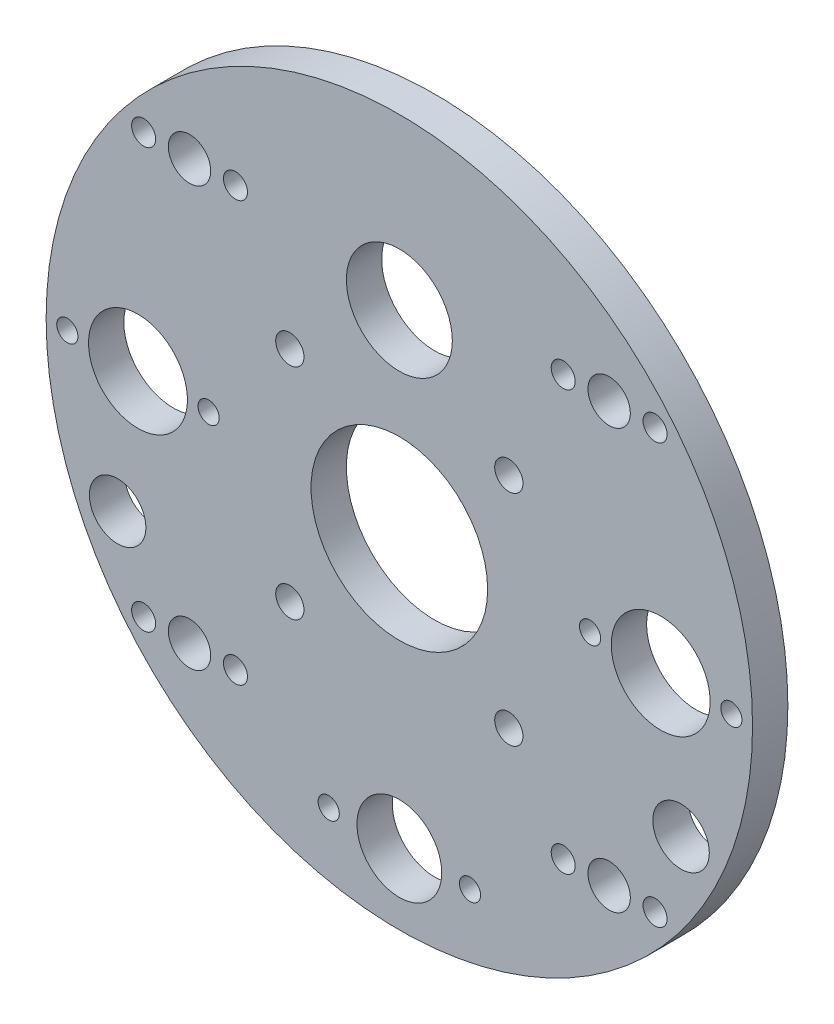
ISO-10303-21;
HEADER;
FILE_DESCRIPTION(('STEP AP214'),'2;1');
FILE_NAME('part.step','',(''),(''),'','','');
FILE_SCHEMA(('AUTOMOTIVE_DESIGN { 1 0 10303 214 1 1 1 1 }'));
ENDSEC;
DATA;
#1=APPLICATION_CONTEXT('core data for automotive mechanical design processes');
#2=APPLICATION_PROTOCOL_DEFINITION('international standard','automotive_design',2000,#1);
#3=PRODUCT_CONTEXT('',#1,'mechanical');
#4=PRODUCT('Part','Part','',(#3));
#5=PRODUCT_RELATED_PRODUCT_CATEGORY('part','',(#4));
#6=PRODUCT_DEFINITION_FORMATION('','',#4);
#7=PRODUCT_DEFINITION_CONTEXT('part definition',#1,'design');
#8=PRODUCT_DEFINITION('design','',#6,#7);
#9=PRODUCT_DEFINITION_SHAPE('','',#8);
#10=(LENGTH_UNIT() NAMED_UNIT(*) SI_UNIT(.MILLI.,.METRE.));
#11=(NAMED_UNIT(*) PLANE_ANGLE_UNIT() SI_UNIT($,.RADIAN.));
#12=(NAMED_UNIT(*) SI_UNIT($,.STERADIAN.) SOLID_ANGLE_UNIT());
#13=UNCERTAINTY_MEASURE_WITH_UNIT(LENGTH_MEASURE(1.E-05),#10,'distance_accuracy_value','');
#14=(GEOMETRIC_REPRESENTATION_CONTEXT(3) GLOBAL_UNCERTAINTY_ASSIGNED_CONTEXT((#13)) GLOBAL_UNIT_ASSIGNED_CONTEXT((#10,
#11,#12)) REPRESENTATION_CONTEXT('',''));
#15=CARTESIAN_POINT('',(0.,0.,0.));
#16=DIRECTION('',(0.,0.,1.));
#17=DIRECTION('',(1.,0.,0.));
#18=AXIS2_PLACEMENT_3D('',#15,#16,#17);
#19=CARTESIAN_POINT('',(0.,0.,5.));
#20=DIRECTION('',(0.,0.,-1.));
#21=DIRECTION('',(-1.,0.,0.));
#22=AXIS2_PLACEMENT_3D('',#19,#20,#21);
#23=CYLINDRICAL_SURFACE('',#22,50.);
#24=CARTESIAN_POINT('',(0.,0.,5.));
#25=DIRECTION('',(0.,0.,1.));
#26=DIRECTION('',(1.,0.,0.));
#27=AXIS2_PLACEMENT_3D('',#24,#25,#26);
#28=CIRCLE('',#27,50.);
#29=CARTESIAN_POINT('',(50.,0.,5.));
#30=VERTEX_POINT('',#29);
#31=EDGE_CURVE('E10',#30,#30,#28,.T.);
#32=ORIENTED_EDGE('',*,*,#31,.F.);
#33=EDGE_LOOP('',(#32));
#34=FACE_BOUND('',#33,.T.);
#35=CARTESIAN_POINT('',(0.,0.,0.));
#36=DIRECTION('',(0.,0.,1.));
#37=DIRECTION('',(1.,0.,0.));
#38=AXIS2_PLACEMENT_3D('',#35,#36,#37);
#39=CIRCLE('',#38,50.);
#40=CARTESIAN_POINT('',(50.,0.,0.));
#41=VERTEX_POINT('',#40);
#42=EDGE_CURVE('E39',#41,#41,#39,.T.);
#43=ORIENTED_EDGE('',*,*,#42,.T.);
#44=EDGE_LOOP('',(#43));
#45=FACE_BOUND('',#44,.T.);
#46=ADVANCED_FACE('F32',(#34,#45),#23,.T.);
#47=CARTESIAN_POINT('',(0.,0.,5.));
#48=DIRECTION('',(0.,0.,1.));
#49=DIRECTION('',(1.,0.,0.));
#50=AXIS2_PLACEMENT_3D('',#47,#48,#49);
#51=PLANE('',#50);
#52=CARTESIAN_POINT('',(36.1984848098349,-29.6984848098351,5.));
#53=DIRECTION('',(0.,0.,1.));
#54=DIRECTION('',(1.,0.,0.));
#55=AXIS2_PLACEMENT_3D('',#52,#53,#54);
#56=CIRCLE('',#55,1.7);
#57=CARTESIAN_POINT('',(37.8984848098349,-29.6984848098351,5.));
#58=VERTEX_POINT('',#57);
#59=EDGE_CURVE('E209',#58,#58,#56,.T.);
#60=ORIENTED_EDGE('',*,*,#59,.F.);
#61=EDGE_LOOP('',(#60));
#62=FACE_BOUND('',#61,.T.);
#63=CARTESIAN_POINT('',(23.1984848098349,-29.6984848098351,5.));
#64=DIRECTION('',(0.,0.,1.));
#65=DIRECTION('',(1.,0.,0.));
#66=AXIS2_PLACEMENT_3D('',#63,#64,#65);
#67=CIRCLE('',#66,1.7);
#68=CARTESIAN_POINT('',(24.8984848098349,-29.6984848098351,5.));
#69=VERTEX_POINT('',#68);
#70=EDGE_CURVE('E213',#69,#69,#67,.T.);
#71=ORIENTED_EDGE('',*,*,#70,.F.);
#72=EDGE_LOOP('',(#71));
#73=FACE_BOUND('',#72,.T.);
#74=CARTESIAN_POINT('',(36.1984848098349,29.6984848098351,5.));
#75=DIRECTION('',(0.,0.,1.));
#76=DIRECTION('',(1.,0.,0.));
#77=AXIS2_PLACEMENT_3D('',#74,#75,#76);
#78=CIRCLE('',#77,1.7);
#79=CARTESIAN_POINT('',(37.8984848098349,29.6984848098351,5.));
#80=VERTEX_POINT('',#79);
#81=EDGE_CURVE('E217',#80,#80,#78,.T.);
#82=ORIENTED_EDGE('',*,*,#81,.F.);
#83=EDGE_LOOP('',(#82));
#84=FACE_BOUND('',#83,.T.);
#85=CARTESIAN_POINT('',(23.1984848098349,29.6984848098351,5.));
#86=DIRECTION('',(0.,0.,1.));
#87=DIRECTION('',(1.,0.,0.));
#88=AXIS2_PLACEMENT_3D('',#85,#86,#87);
#89=CIRCLE('',#88,1.7);
#90=CARTESIAN_POINT('',(24.8984848098349,29.6984848098351,5.));
#91=VERTEX_POINT('',#90);
#92=EDGE_CURVE('E221',#91,#91,#89,.T.);
#93=ORIENTED_EDGE('',*,*,#92,.F.);
#94=EDGE_LOOP('',(#93));
#95=FACE_BOUND('',#94,.T.);
#96=CARTESIAN_POINT('',(-36.1984848098349,29.6984848098351,5.));
#97=DIRECTION('',(0.,0.,1.));
#98=DIRECTION('',(1.,0.,0.));
#99=AXIS2_PLACEMENT_3D('',#96,#97,#98);
#100=CIRCLE('',#99,1.7);
#101=CARTESIAN_POINT('',(-34.4984848098349,29.6984848098351,5.));
#102=VERTEX_POINT('',#101);
#103=EDGE_CURVE('E225',#102,#102,#100,.T.);
#104=ORIENTED_EDGE('',*,*,#103,.F.);
#105=EDGE_LOOP('',(#104));
#106=FACE_BOUND('',#105,.T.);
#107=CARTESIAN_POINT('',(-23.1984848098349,29.6984848098351,5.));
#108=DIRECTION('',(0.,0.,1.));
#109=DIRECTION('',(1.,0.,0.));
#110=AXIS2_PLACEMENT_3D('',#107,#108,#109);
#111=CIRCLE('',#110,1.7);
#112=CARTESIAN_POINT('',(-21.4984848098349,29.6984848098351,5.));
#113=VERTEX_POINT('',#112);
#114=EDGE_CURVE('E229',#113,#113,#111,.T.);
#115=ORIENTED_EDGE('',*,*,#114,.F.);
#116=EDGE_LOOP('',(#115));
#117=FACE_BOUND('',#116,.T.);
#118=CARTESIAN_POINT('',(-36.1984848098349,-29.6984848098351,5.));
#119=DIRECTION('',(0.,0.,1.));
#120=DIRECTION('',(1.,0.,0.));
#121=AXIS2_PLACEMENT_3D('',#118,#119,#120);
#122=CIRCLE('',#121,1.7);
#123=CARTESIAN_POINT('',(-34.4984848098349,-29.6984848098351,5.));
#124=VERTEX_POINT('',#123);
#125=EDGE_CURVE('E233',#124,#124,#122,.T.);
#126=ORIENTED_EDGE('',*,*,#125,.F.);
#127=EDGE_LOOP('',(#126));
#128=FACE_BOUND('',#127,.T.);
#129=CARTESIAN_POINT('',(-23.1984848098349,-29.6984848098351,5.));
#130=DIRECTION('',(0.,0.,1.));
#131=DIRECTION('',(1.,0.,0.));
#132=AXIS2_PLACEMENT_3D('',#129,#130,#131);
#133=CIRCLE('',#132,1.7);
#134=CARTESIAN_POINT('',(-21.4984848098349,-29.6984848098351,5.));
#135=VERTEX_POINT('',#134);
#136=EDGE_CURVE('E237',#135,#135,#133,.T.);
#137=ORIENTED_EDGE('',*,*,#136,.F.);
#138=EDGE_LOOP('',(#137));
#139=FACE_BOUND('',#138,.T.);
#140=CARTESIAN_POINT('',(-39.8775426296126,-18.5952035165907,5.));
#141=DIRECTION('',(0.,0.,1.));
#142=DIRECTION('',(1.,0.,0.));
#143=AXIS2_PLACEMENT_3D('',#140,#141,#142);
#144=CIRCLE('',#143,4.00000000000001);
#145=CARTESIAN_POINT('',(-35.8775426296126,-18.5952035165907,5.));
#146=VERTEX_POINT('',#145);
#147=EDGE_CURVE('E109',#146,#146,#144,.T.);
#148=ORIENTED_EDGE('',*,*,#147,.F.);
#149=EDGE_LOOP('',(#148));
#150=FACE_BOUND('',#149,.T.);
#151=CARTESIAN_POINT('',(39.8775426296126,-18.5952035165907,5.));
#152=DIRECTION('',(0.,0.,1.));
#153=DIRECTION('',(-1.,0.,0.));
#154=AXIS2_PLACEMENT_3D('',#151,#152,#153);
#155=CIRCLE('',#154,4.00000000000001);
#156=CARTESIAN_POINT('',(35.8775426296126,-18.5952035165907,5.));
#157=VERTEX_POINT('',#156);
#158=EDGE_CURVE('E115',#157,#157,#155,.T.);
#159=ORIENTED_EDGE('',*,*,#158,.F.);
#160=EDGE_LOOP('',(#159));
#161=FACE_BOUND('',#160,.T.);
#162=CARTESIAN_POINT('',(-47.,0.,5.));
#163=DIRECTION('',(0.,0.,1.));
#164=DIRECTION('',(1.,0.,0.));
#165=AXIS2_PLACEMENT_3D('',#162,#163,#164);
#166=CIRCLE('',#165,1.5);
#167=CARTESIAN_POINT('',(-45.5,0.,5.));
#168=VERTEX_POINT('',#167);
#169=EDGE_CURVE('E89',#168,#168,#166,.T.);
#170=ORIENTED_EDGE('',*,*,#169,.F.);
#171=EDGE_LOOP('',(#170));
#172=FACE_BOUND('',#171,.T.);
#173=CARTESIAN_POINT('',(0.,-40.,5.));
#174=DIRECTION('',(0.,0.,1.));
#175=DIRECTION('',(1.,0.,0.));
#176=AXIS2_PLACEMENT_3D('',#173,#174,#175);
#177=CIRCLE('',#176,6.);
#178=CARTESIAN_POINT('',(6.,-40.,5.));
#179=VERTEX_POINT('',#178);
#180=EDGE_CURVE('E113',#179,#179,#177,.T.);
#181=ORIENTED_EDGE('',*,*,#180,.F.);
#182=EDGE_LOOP('',(#181));
#183=FACE_BOUND('',#182,.T.);
#184=CARTESIAN_POINT('',(10.,-40.,5.));
#185=DIRECTION('',(0.,0.,1.));
#186=DIRECTION('',(1.,0.,0.));
#187=AXIS2_PLACEMENT_3D('',#184,#185,#186);
#188=CIRCLE('',#187,1.5);
#189=CARTESIAN_POINT('',(11.5,-40.,5.));
#190=VERTEX_POINT('',#189);
#191=EDGE_CURVE('E128',#190,#190,#188,.T.);
#192=ORIENTED_EDGE('',*,*,#191,.F.);
#193=EDGE_LOOP('',(#192));
#194=FACE_BOUND('',#193,.T.);
#195=CARTESIAN_POINT('',(-27.,0.,5.));
#196=DIRECTION('',(0.,0.,1.));
#197=DIRECTION('',(1.,0.,0.));
#198=AXIS2_PLACEMENT_3D('',#195,#196,#197);
#199=CIRCLE('',#198,1.5);
#200=CARTESIAN_POINT('',(-25.5,0.,5.));
#201=VERTEX_POINT('',#200);
#202=EDGE_CURVE('E127',#201,#201,#199,.T.);
#203=ORIENTED_EDGE('',*,*,#202,.F.);
#204=EDGE_LOOP('',(#203));
#205=FACE_BOUND('',#204,.T.);
#206=CARTESIAN_POINT('',(27.,0.,5.));
#207=DIRECTION('',(0.,0.,1.));
#208=DIRECTION('',(1.,0.,0.));
#209=AXIS2_PLACEMENT_3D('',#206,#207,#208);
#210=CIRCLE('',#209,1.5);
#211=CARTESIAN_POINT('',(28.5,0.,5.));
#212=VERTEX_POINT('',#211);
#213=EDGE_CURVE('E137',#212,#212,#210,.T.);
#214=ORIENTED_EDGE('',*,*,#213,.F.);
#215=EDGE_LOOP('',(#214));
#216=FACE_BOUND('',#215,.T.);
#217=CARTESIAN_POINT('',(47.,0.,5.));
#218=DIRECTION('',(0.,0.,1.));
#219=DIRECTION('',(1.,0.,0.));
#220=AXIS2_PLACEMENT_3D('',#217,#218,#219);
#221=CIRCLE('',#220,1.5);
#222=CARTESIAN_POINT('',(48.5,0.,5.));
#223=VERTEX_POINT('',#222);
#224=EDGE_CURVE('E134',#223,#223,#221,.T.);
#225=ORIENTED_EDGE('',*,*,#224,.F.);
#226=EDGE_LOOP('',(#225));
#227=FACE_BOUND('',#226,.T.);
#228=CARTESIAN_POINT('',(-10.,-40.,5.));
#229=DIRECTION('',(0.,0.,1.));
#230=DIRECTION('',(1.,0.,0.));
#231=AXIS2_PLACEMENT_3D('',#228,#229,#230);
#232=CIRCLE('',#231,1.5);
#233=CARTESIAN_POINT('',(-8.5,-40.,5.));
#234=VERTEX_POINT('',#233);
#235=EDGE_CURVE('E131',#234,#234,#232,.T.);
#236=ORIENTED_EDGE('',*,*,#235,.F.);
#237=EDGE_LOOP('',(#236));
#238=FACE_BOUND('',#237,.T.);
#239=CARTESIAN_POINT('',(-29.6984848098349,-29.6984848098351,5.));
#240=DIRECTION('',(0.,0.,1.));
#241=DIRECTION('',(0.,1.,0.));
#242=AXIS2_PLACEMENT_3D('',#239,#240,#241);
#243=CIRCLE('',#242,3.);
#244=CARTESIAN_POINT('',(-29.6984848098349,-26.6984848098351,5.));
#245=VERTEX_POINT('',#244);
#246=EDGE_CURVE('E79',#245,#245,#243,.T.);
#247=ORIENTED_EDGE('',*,*,#246,.F.);
#248=EDGE_LOOP('',(#247));
#249=FACE_BOUND('',#248,.T.);
#250=CARTESIAN_POINT('',(29.6984848098349,-29.698484809835,5.));
#251=DIRECTION('',(0.,0.,1.));
#252=DIRECTION('',(-1.,0.,0.));
#253=AXIS2_PLACEMENT_3D('',#250,#251,#252);
#254=CIRCLE('',#253,3.);
#255=CARTESIAN_POINT('',(26.698484809835,-29.698484809835,5.));
#256=VERTEX_POINT('',#255);
#257=EDGE_CURVE('E146',#256,#256,#254,.T.);
#258=ORIENTED_EDGE('',*,*,#257,.F.);
#259=EDGE_LOOP('',(#258));
#260=FACE_BOUND('',#259,.T.);
#261=CARTESIAN_POINT('',(29.6984848098347,29.6984848098353,5.));
#262=DIRECTION('',(0.,0.,1.));
#263=DIRECTION('',(0.,-1.,0.));
#264=AXIS2_PLACEMENT_3D('',#261,#262,#263);
#265=CIRCLE('',#264,3.);
#266=CARTESIAN_POINT('',(29.6984848098348,26.6984848098353,5.));
#267=VERTEX_POINT('',#266);
#268=EDGE_CURVE('E106',#267,#267,#265,.T.);
#269=ORIENTED_EDGE('',*,*,#268,.F.);
#270=EDGE_LOOP('',(#269));
#271=FACE_BOUND('',#270,.T.);
#272=CARTESIAN_POINT('',(-29.6984848098349,29.698484809835,5.));
#273=DIRECTION('',(0.,0.,1.));
#274=DIRECTION('',(1.,0.,0.));
#275=AXIS2_PLACEMENT_3D('',#272,#273,#274);
#276=CIRCLE('',#275,3.);
#277=CARTESIAN_POINT('',(-26.698484809835,29.698484809835,5.));
#278=VERTEX_POINT('',#277);
#279=EDGE_CURVE('E74',#278,#278,#276,.T.);
#280=ORIENTED_EDGE('',*,*,#279,.F.);
#281=EDGE_LOOP('',(#280));
#282=FACE_BOUND('',#281,.T.);
#283=CARTESIAN_POINT('',(-15.4999999999989,-17.5000000000002,5.));
#284=DIRECTION('',(0.,0.,1.));
#285=DIRECTION('',(1.,0.,0.));
#286=AXIS2_PLACEMENT_3D('',#283,#284,#285);
#287=CIRCLE('',#286,2.);
#288=CARTESIAN_POINT('',(-13.4999999999989,-17.5000000000002,5.));
#289=VERTEX_POINT('',#288);
#290=EDGE_CURVE('E73',#289,#289,#287,.T.);
#291=ORIENTED_EDGE('',*,*,#290,.F.);
#292=EDGE_LOOP('',(#291));
#293=FACE_BOUND('',#292,.T.);
#294=CARTESIAN_POINT('',(15.5000000000015,-17.4999999999992,5.));
#295=DIRECTION('',(0.,0.,1.));
#296=DIRECTION('',(1.,0.,0.));
#297=AXIS2_PLACEMENT_3D('',#294,#295,#296);
#298=CIRCLE('',#297,2.);
#299=CARTESIAN_POINT('',(17.5000000000015,-17.4999999999992,5.));
#300=VERTEX_POINT('',#299);
#301=EDGE_CURVE('E159',#300,#300,#298,.T.);
#302=ORIENTED_EDGE('',*,*,#301,.F.);
#303=EDGE_LOOP('',(#302));
#304=FACE_BOUND('',#303,.T.);
#305=CARTESIAN_POINT('',(15.5000000000004,13.5000000000012,5.));
#306=DIRECTION('',(0.,0.,1.));
#307=DIRECTION('',(1.,0.,0.));
#308=AXIS2_PLACEMENT_3D('',#305,#306,#307);
#309=CIRCLE('',#308,2.);
#310=CARTESIAN_POINT('',(17.5000000000004,13.5000000000012,5.));
#311=VERTEX_POINT('',#310);
#312=EDGE_CURVE('E156',#311,#311,#309,.T.);
#313=ORIENTED_EDGE('',*,*,#312,.F.);
#314=EDGE_LOOP('',(#313));
#315=FACE_BOUND('',#314,.T.);
#316=CARTESIAN_POINT('',(-15.5,13.5,5.));
#317=DIRECTION('',(0.,0.,1.));
#318=DIRECTION('',(1.,0.,0.));
#319=AXIS2_PLACEMENT_3D('',#316,#317,#318);
#320=CIRCLE('',#319,2.);
#321=CARTESIAN_POINT('',(-13.5,13.5,5.));
#322=VERTEX_POINT('',#321);
#323=EDGE_CURVE('E153',#322,#322,#320,.T.);
#324=ORIENTED_EDGE('',*,*,#323,.F.);
#325=EDGE_LOOP('',(#324));
#326=FACE_BOUND('',#325,.T.);
#327=CARTESIAN_POINT('',(0.,-2.,5.));
#328=DIRECTION('',(0.,0.,1.));
#329=DIRECTION('',(1.,0.,0.));
#330=AXIS2_PLACEMENT_3D('',#327,#328,#329);
#331=CIRCLE('',#330,12.5);
#332=CARTESIAN_POINT('',(12.5,-2.,5.));
#333=VERTEX_POINT('',#332);
#334=EDGE_CURVE('E58',#333,#333,#331,.T.);
#335=ORIENTED_EDGE('',*,*,#334,.F.);
#336=EDGE_LOOP('',(#335));
#337=FACE_BOUND('',#336,.T.);
#338=CARTESIAN_POINT('',(0.,26.,5.));
#339=DIRECTION('',(0.,0.,1.));
#340=DIRECTION('',(1.,0.,0.));
#341=AXIS2_PLACEMENT_3D('',#338,#339,#340);
#342=CIRCLE('',#341,7.5);
#343=CARTESIAN_POINT('',(7.5,26.,5.));
#344=VERTEX_POINT('',#343);
#345=EDGE_CURVE('E53',#344,#344,#342,.T.);
#346=ORIENTED_EDGE('',*,*,#345,.F.);
#347=EDGE_LOOP('',(#346));
#348=FACE_BOUND('',#347,.T.);
#349=CARTESIAN_POINT('',(-37.,0.,5.));
#350=DIRECTION('',(0.,0.,-1.));
#351=DIRECTION('',(-1.,0.,0.));
#352=AXIS2_PLACEMENT_3D('',#349,#350,#351);
#353=CIRCLE('',#352,7.);
#354=CARTESIAN_POINT('',(-44.,0.,5.));
#355=VERTEX_POINT('',#354);
#356=EDGE_CURVE('E170',#355,#355,#353,.T.);
#357=ORIENTED_EDGE('',*,*,#356,.T.);
#358=EDGE_LOOP('',(#357));
#359=FACE_BOUND('',#358,.T.);
#360=CARTESIAN_POINT('',(37.,2.68166793467571E-13,5.));
#361=DIRECTION('',(0.,0.,-1.));
#362=DIRECTION('',(-1.,0.,0.));
#363=AXIS2_PLACEMENT_3D('',#360,#361,#362);
#364=CIRCLE('',#363,7.);
#365=CARTESIAN_POINT('',(30.,2.68166793467571E-13,5.));
#366=VERTEX_POINT('',#365);
#367=EDGE_CURVE('E44',#366,#366,#364,.T.);
#368=ORIENTED_EDGE('',*,*,#367,.T.);
#369=EDGE_LOOP('',(#368));
#370=FACE_BOUND('',#369,.T.);
#371=ORIENTED_EDGE('',*,*,#31,.T.);
#372=EDGE_LOOP('',(#371));
#373=FACE_BOUND('',#372,.T.);
#374=ADVANCED_FACE('F179',(#62,#73,#84,#95,#106,#117,#128,#139,#150,#161,#172,#183,#194,#205,
#216,#227,#238,#249,#260,#271,#282,#293,#304,#315,#326,#337,#348,#359,#370,#373),#51,.T.);
#375=CARTESIAN_POINT('',(0.,0.,0.));
#376=DIRECTION('',(0.,0.,1.));
#377=DIRECTION('',(1.,0.,0.));
#378=AXIS2_PLACEMENT_3D('',#375,#376,#377);
#379=PLANE('',#378);
#380=CARTESIAN_POINT('',(36.1984848098349,-29.6984848098351,0.));
#381=DIRECTION('',(0.,0.,1.));
#382=DIRECTION('',(1.,0.,0.));
#383=AXIS2_PLACEMENT_3D('',#380,#381,#382);
#384=CIRCLE('',#383,1.7);
#385=CARTESIAN_POINT('',(37.8984848098349,-29.6984848098351,0.));
#386=VERTEX_POINT('',#385);
#387=EDGE_CURVE('E396',#386,#386,#384,.T.);
#388=ORIENTED_EDGE('',*,*,#387,.T.);
#389=EDGE_LOOP('',(#388));
#390=FACE_BOUND('',#389,.T.);
#391=CARTESIAN_POINT('',(23.1984848098349,-29.6984848098351,0.));
#392=DIRECTION('',(0.,0.,1.));
#393=DIRECTION('',(1.,0.,0.));
#394=AXIS2_PLACEMENT_3D('',#391,#392,#393);
#395=CIRCLE('',#394,1.7);
#396=CARTESIAN_POINT('',(24.8984848098349,-29.6984848098351,0.));
#397=VERTEX_POINT('',#396);
#398=EDGE_CURVE('E401',#397,#397,#395,.T.);
#399=ORIENTED_EDGE('',*,*,#398,.T.);
#400=EDGE_LOOP('',(#399));
#401=FACE_BOUND('',#400,.T.);
#402=CARTESIAN_POINT('',(36.1984848098349,29.6984848098351,0.));
#403=DIRECTION('',(0.,0.,1.));
#404=DIRECTION('',(1.,0.,0.));
#405=AXIS2_PLACEMENT_3D('',#402,#403,#404);
#406=CIRCLE('',#405,1.7);
#407=CARTESIAN_POINT('',(37.8984848098349,29.6984848098351,0.));
#408=VERTEX_POINT('',#407);
#409=EDGE_CURVE('E405',#408,#408,#406,.T.);
#410=ORIENTED_EDGE('',*,*,#409,.T.);
#411=EDGE_LOOP('',(#410));
#412=FACE_BOUND('',#411,.T.);
#413=CARTESIAN_POINT('',(23.1984848098349,29.6984848098351,0.));
#414=DIRECTION('',(0.,0.,1.));
#415=DIRECTION('',(1.,0.,0.));
#416=AXIS2_PLACEMENT_3D('',#413,#414,#415);
#417=CIRCLE('',#416,1.7);
#418=CARTESIAN_POINT('',(24.8984848098349,29.6984848098351,0.));
#419=VERTEX_POINT('',#418);
#420=EDGE_CURVE('E409',#419,#419,#417,.T.);
#421=ORIENTED_EDGE('',*,*,#420,.T.);
#422=EDGE_LOOP('',(#421));
#423=FACE_BOUND('',#422,.T.);
#424=CARTESIAN_POINT('',(-36.1984848098349,29.6984848098351,0.));
#425=DIRECTION('',(0.,0.,1.));
#426=DIRECTION('',(1.,0.,0.));
#427=AXIS2_PLACEMENT_3D('',#424,#425,#426);
#428=CIRCLE('',#427,1.7);
#429=CARTESIAN_POINT('',(-34.4984848098349,29.6984848098351,0.));
#430=VERTEX_POINT('',#429);
#431=EDGE_CURVE('E413',#430,#430,#428,.T.);
#432=ORIENTED_EDGE('',*,*,#431,.T.);
#433=EDGE_LOOP('',(#432));
#434=FACE_BOUND('',#433,.T.);
#435=CARTESIAN_POINT('',(-23.1984848098349,29.6984848098351,0.));
#436=DIRECTION('',(0.,0.,1.));
#437=DIRECTION('',(1.,0.,0.));
#438=AXIS2_PLACEMENT_3D('',#435,#436,#437);
#439=CIRCLE('',#438,1.7);
#440=CARTESIAN_POINT('',(-21.4984848098349,29.6984848098351,0.));
#441=VERTEX_POINT('',#440);
#442=EDGE_CURVE('E417',#441,#441,#439,.T.);
#443=ORIENTED_EDGE('',*,*,#442,.T.);
#444=EDGE_LOOP('',(#443));
#445=FACE_BOUND('',#444,.T.);
#446=CARTESIAN_POINT('',(-36.1984848098349,-29.6984848098351,0.));
#447=DIRECTION('',(0.,0.,1.));
#448=DIRECTION('',(1.,0.,0.));
#449=AXIS2_PLACEMENT_3D('',#446,#447,#448);
#450=CIRCLE('',#449,1.7);
#451=CARTESIAN_POINT('',(-34.4984848098349,-29.6984848098351,0.));
#452=VERTEX_POINT('',#451);
#453=EDGE_CURVE('E421',#452,#452,#450,.T.);
#454=ORIENTED_EDGE('',*,*,#453,.T.);
#455=EDGE_LOOP('',(#454));
#456=FACE_BOUND('',#455,.T.);
#457=CARTESIAN_POINT('',(-23.1984848098349,-29.6984848098351,0.));
#458=DIRECTION('',(0.,0.,1.));
#459=DIRECTION('',(1.,0.,0.));
#460=AXIS2_PLACEMENT_3D('',#457,#458,#459);
#461=CIRCLE('',#460,1.7);
#462=CARTESIAN_POINT('',(-21.4984848098349,-29.6984848098351,0.));
#463=VERTEX_POINT('',#462);
#464=EDGE_CURVE('E120',#463,#463,#461,.T.);
#465=ORIENTED_EDGE('',*,*,#464,.T.);
#466=EDGE_LOOP('',(#465));
#467=FACE_BOUND('',#466,.T.);
#468=CARTESIAN_POINT('',(-39.8775426296126,-18.5952035165907,0.));
#469=DIRECTION('',(0.,0.,1.));
#470=DIRECTION('',(1.,0.,0.));
#471=AXIS2_PLACEMENT_3D('',#468,#469,#470);
#472=CIRCLE('',#471,4.00000000000001);
#473=CARTESIAN_POINT('',(-35.8775426296126,-18.5952035165907,0.));
#474=VERTEX_POINT('',#473);
#475=EDGE_CURVE('E35',#474,#474,#472,.T.);
#476=ORIENTED_EDGE('',*,*,#475,.T.);
#477=EDGE_LOOP('',(#476));
#478=FACE_BOUND('',#477,.T.);
#479=CARTESIAN_POINT('',(39.8775426296126,-18.5952035165907,0.));
#480=DIRECTION('',(0.,0.,1.));
#481=DIRECTION('',(1.,0.,0.));
#482=AXIS2_PLACEMENT_3D('',#479,#480,#481);
#483=CIRCLE('',#482,4.00000000000001);
#484=CARTESIAN_POINT('',(43.8775426296126,-18.5952035165907,0.));
#485=VERTEX_POINT('',#484);
#486=EDGE_CURVE('E107',#485,#485,#483,.T.);
#487=ORIENTED_EDGE('',*,*,#486,.T.);
#488=EDGE_LOOP('',(#487));
#489=FACE_BOUND('',#488,.T.);
#490=CARTESIAN_POINT('',(-47.,0.,0.));
#491=DIRECTION('',(0.,0.,1.));
#492=DIRECTION('',(1.,0.,0.));
#493=AXIS2_PLACEMENT_3D('',#490,#491,#492);
#494=CIRCLE('',#493,1.5);
#495=CARTESIAN_POINT('',(-45.5,0.,0.));
#496=VERTEX_POINT('',#495);
#497=EDGE_CURVE('E104',#496,#496,#494,.T.);
#498=ORIENTED_EDGE('',*,*,#497,.T.);
#499=EDGE_LOOP('',(#498));
#500=FACE_BOUND('',#499,.T.);
#501=CARTESIAN_POINT('',(0.,-40.,0.));
#502=DIRECTION('',(0.,0.,1.));
#503=DIRECTION('',(1.,0.,0.));
#504=AXIS2_PLACEMENT_3D('',#501,#502,#503);
#505=CIRCLE('',#504,6.);
#506=CARTESIAN_POINT('',(6.,-40.,0.));
#507=VERTEX_POINT('',#506);
#508=EDGE_CURVE('E101',#507,#507,#505,.T.);
#509=ORIENTED_EDGE('',*,*,#508,.T.);
#510=EDGE_LOOP('',(#509));
#511=FACE_BOUND('',#510,.T.);
#512=CARTESIAN_POINT('',(10.,-40.,0.));
#513=DIRECTION('',(0.,0.,1.));
#514=DIRECTION('',(1.,0.,0.));
#515=AXIS2_PLACEMENT_3D('',#512,#513,#514);
#516=CIRCLE('',#515,1.5);
#517=CARTESIAN_POINT('',(11.5,-40.,0.));
#518=VERTEX_POINT('',#517);
#519=EDGE_CURVE('E98',#518,#518,#516,.T.);
#520=ORIENTED_EDGE('',*,*,#519,.T.);
#521=EDGE_LOOP('',(#520));
#522=FACE_BOUND('',#521,.T.);
#523=CARTESIAN_POINT('',(-27.,0.,0.));
#524=DIRECTION('',(0.,0.,1.));
#525=DIRECTION('',(1.,0.,0.));
#526=AXIS2_PLACEMENT_3D('',#523,#524,#525);
#527=CIRCLE('',#526,1.5);
#528=CARTESIAN_POINT('',(-25.5,0.,0.));
#529=VERTEX_POINT('',#528);
#530=EDGE_CURVE('E95',#529,#529,#527,.T.);
#531=ORIENTED_EDGE('',*,*,#530,.T.);
#532=EDGE_LOOP('',(#531));
#533=FACE_BOUND('',#532,.T.);
#534=CARTESIAN_POINT('',(27.,0.,0.));
#535=DIRECTION('',(0.,0.,1.));
#536=DIRECTION('',(1.,0.,0.));
#537=AXIS2_PLACEMENT_3D('',#534,#535,#536);
#538=CIRCLE('',#537,1.5);
#539=CARTESIAN_POINT('',(28.5,0.,0.));
#540=VERTEX_POINT('',#539);
#541=EDGE_CURVE('E92',#540,#540,#538,.T.);
#542=ORIENTED_EDGE('',*,*,#541,.T.);
#543=EDGE_LOOP('',(#542));
#544=FACE_BOUND('',#543,.T.);
#545=CARTESIAN_POINT('',(47.,0.,0.));
#546=DIRECTION('',(0.,0.,1.));
#547=DIRECTION('',(1.,0.,0.));
#548=AXIS2_PLACEMENT_3D('',#545,#546,#547);
#549=CIRCLE('',#548,1.5);
#550=CARTESIAN_POINT('',(48.5,0.,0.));
#551=VERTEX_POINT('',#550);
#552=EDGE_CURVE('E88',#551,#551,#549,.T.);
#553=ORIENTED_EDGE('',*,*,#552,.T.);
#554=EDGE_LOOP('',(#553));
#555=FACE_BOUND('',#554,.T.);
#556=CARTESIAN_POINT('',(-10.,-40.,0.));
#557=DIRECTION('',(0.,0.,1.));
#558=DIRECTION('',(1.,0.,0.));
#559=AXIS2_PLACEMENT_3D('',#556,#557,#558);
#560=CIRCLE('',#559,1.5);
#561=CARTESIAN_POINT('',(-8.5,-40.,0.));
#562=VERTEX_POINT('',#561);
#563=EDGE_CURVE('E85',#562,#562,#560,.T.);
#564=ORIENTED_EDGE('',*,*,#563,.T.);
#565=EDGE_LOOP('',(#564));
#566=FACE_BOUND('',#565,.T.);
#567=CARTESIAN_POINT('',(-29.6984848098349,-29.6984848098351,0.));
#568=DIRECTION('',(0.,0.,1.));
#569=DIRECTION('',(1.,0.,0.));
#570=AXIS2_PLACEMENT_3D('',#567,#568,#569);
#571=CIRCLE('',#570,3.);
#572=CARTESIAN_POINT('',(-26.6984848098349,-29.6984848098351,0.));
#573=VERTEX_POINT('',#572);
#574=EDGE_CURVE('E82',#573,#573,#571,.T.);
#575=ORIENTED_EDGE('',*,*,#574,.T.);
#576=EDGE_LOOP('',(#575));
#577=FACE_BOUND('',#576,.T.);
#578=CARTESIAN_POINT('',(29.6984848098349,-29.698484809835,0.));
#579=DIRECTION('',(0.,0.,1.));
#580=DIRECTION('',(1.,0.,0.));
#581=AXIS2_PLACEMENT_3D('',#578,#579,#580);
#582=CIRCLE('',#581,3.);
#583=CARTESIAN_POINT('',(32.698484809835,-29.698484809835,0.));
#584=VERTEX_POINT('',#583);
#585=EDGE_CURVE('E78',#584,#584,#582,.T.);
#586=ORIENTED_EDGE('',*,*,#585,.T.);
#587=EDGE_LOOP('',(#586));
#588=FACE_BOUND('',#587,.T.);
#589=CARTESIAN_POINT('',(29.6984848098347,29.6984848098353,0.));
#590=DIRECTION('',(0.,0.,1.));
#591=DIRECTION('',(1.,0.,0.));
#592=AXIS2_PLACEMENT_3D('',#589,#590,#591);
#593=CIRCLE('',#592,3.);
#594=CARTESIAN_POINT('',(32.6984848098347,29.6984848098353,0.));
#595=VERTEX_POINT('',#594);
#596=EDGE_CURVE('E75',#595,#595,#593,.T.);
#597=ORIENTED_EDGE('',*,*,#596,.T.);
#598=EDGE_LOOP('',(#597));
#599=FACE_BOUND('',#598,.T.);
#600=CARTESIAN_POINT('',(-29.6984848098349,29.698484809835,0.));
#601=DIRECTION('',(0.,0.,1.));
#602=DIRECTION('',(1.,0.,0.));
#603=AXIS2_PLACEMENT_3D('',#600,#601,#602);
#604=CIRCLE('',#603,3.);
#605=CARTESIAN_POINT('',(-26.698484809835,29.698484809835,0.));
#606=VERTEX_POINT('',#605);
#607=EDGE_CURVE('E70',#606,#606,#604,.T.);
#608=ORIENTED_EDGE('',*,*,#607,.T.);
#609=EDGE_LOOP('',(#608));
#610=FACE_BOUND('',#609,.T.);
#611=CARTESIAN_POINT('',(-15.4999999999989,-17.5000000000002,0.));
#612=DIRECTION('',(0.,0.,1.));
#613=DIRECTION('',(1.,0.,0.));
#614=AXIS2_PLACEMENT_3D('',#611,#612,#613);
#615=CIRCLE('',#614,2.);
#616=CARTESIAN_POINT('',(-13.4999999999989,-17.5000000000002,0.));
#617=VERTEX_POINT('',#616);
#618=EDGE_CURVE('E67',#617,#617,#615,.T.);
#619=ORIENTED_EDGE('',*,*,#618,.T.);
#620=EDGE_LOOP('',(#619));
#621=FACE_BOUND('',#620,.T.);
#622=CARTESIAN_POINT('',(15.5000000000015,-17.4999999999992,0.));
#623=DIRECTION('',(0.,0.,1.));
#624=DIRECTION('',(1.,0.,0.));
#625=AXIS2_PLACEMENT_3D('',#622,#623,#624);
#626=CIRCLE('',#625,2.);
#627=CARTESIAN_POINT('',(17.5000000000015,-17.4999999999992,0.));
#628=VERTEX_POINT('',#627);
#629=EDGE_CURVE('E64',#628,#628,#626,.T.);
#630=ORIENTED_EDGE('',*,*,#629,.T.);
#631=EDGE_LOOP('',(#630));
#632=FACE_BOUND('',#631,.T.);
#633=CARTESIAN_POINT('',(15.5000000000004,13.5000000000012,0.));
#634=DIRECTION('',(0.,0.,1.));
#635=DIRECTION('',(1.,0.,0.));
#636=AXIS2_PLACEMENT_3D('',#633,#634,#635);
#637=CIRCLE('',#636,2.);
#638=CARTESIAN_POINT('',(17.5000000000004,13.5000000000012,0.));
#639=VERTEX_POINT('',#638);
#640=EDGE_CURVE('E61',#639,#639,#637,.T.);
#641=ORIENTED_EDGE('',*,*,#640,.T.);
#642=EDGE_LOOP('',(#641));
#643=FACE_BOUND('',#642,.T.);
#644=CARTESIAN_POINT('',(-15.5,13.5,0.));
#645=DIRECTION('',(0.,0.,1.));
#646=DIRECTION('',(1.,0.,0.));
#647=AXIS2_PLACEMENT_3D('',#644,#645,#646);
#648=CIRCLE('',#647,2.);
#649=CARTESIAN_POINT('',(-13.5,13.5,0.));
#650=VERTEX_POINT('',#649);
#651=EDGE_CURVE('E57',#650,#650,#648,.T.);
#652=ORIENTED_EDGE('',*,*,#651,.T.);
#653=EDGE_LOOP('',(#652));
#654=FACE_BOUND('',#653,.T.);
#655=CARTESIAN_POINT('',(0.,-2.,0.));
#656=DIRECTION('',(0.,0.,1.));
#657=DIRECTION('',(1.,0.,0.));
#658=AXIS2_PLACEMENT_3D('',#655,#656,#657);
#659=CIRCLE('',#658,12.5);
#660=CARTESIAN_POINT('',(12.5,-2.,0.));
#661=VERTEX_POINT('',#660);
#662=EDGE_CURVE('E54',#661,#661,#659,.T.);
#663=ORIENTED_EDGE('',*,*,#662,.T.);
#664=EDGE_LOOP('',(#663));
#665=FACE_BOUND('',#664,.T.);
#666=CARTESIAN_POINT('',(0.,26.,0.));
#667=DIRECTION('',(0.,0.,1.));
#668=DIRECTION('',(1.,0.,0.));
#669=AXIS2_PLACEMENT_3D('',#666,#667,#668);
#670=CIRCLE('',#669,7.5);
#671=CARTESIAN_POINT('',(7.5,26.,0.));
#672=VERTEX_POINT('',#671);
#673=EDGE_CURVE('E49',#672,#672,#670,.T.);
#674=ORIENTED_EDGE('',*,*,#673,.T.);
#675=EDGE_LOOP('',(#674));
#676=FACE_BOUND('',#675,.T.);
#677=CARTESIAN_POINT('',(-37.,0.,0.));
#678=DIRECTION('',(0.,0.,-1.));
#679=DIRECTION('',(-1.,0.,0.));
#680=AXIS2_PLACEMENT_3D('',#677,#678,#679);
#681=CIRCLE('',#680,7.);
#682=CARTESIAN_POINT('',(-44.,0.,0.));
#683=VERTEX_POINT('',#682);
#684=EDGE_CURVE('E52',#683,#683,#681,.T.);
#685=ORIENTED_EDGE('',*,*,#684,.F.);
#686=EDGE_LOOP('',(#685));
#687=FACE_BOUND('',#686,.T.);
#688=CARTESIAN_POINT('',(37.,2.68166793467571E-13,0.));
#689=DIRECTION('',(0.,0.,-1.));
#690=DIRECTION('',(-1.,0.,0.));
#691=AXIS2_PLACEMENT_3D('',#688,#689,#690);
#692=CIRCLE('',#691,7.);
#693=CARTESIAN_POINT('',(30.,2.68166793467571E-13,0.));
#694=VERTEX_POINT('',#693);
#695=EDGE_CURVE('E172',#694,#694,#692,.T.);
#696=ORIENTED_EDGE('',*,*,#695,.F.);
#697=EDGE_LOOP('',(#696));
#698=FACE_BOUND('',#697,.T.);
#699=ORIENTED_EDGE('',*,*,#42,.F.);
#700=EDGE_LOOP('',(#699));
#701=FACE_BOUND('',#700,.T.);
#702=ADVANCED_FACE('F184',(#390,#401,#412,#423,#434,#445,#456,#467,#478,#489,#500,#511,#522,
#533,#544,#555,#566,#577,#588,#599,#610,#621,#632,#643,#654,#665,#676,#687,#698,#701),#379,.F.);
#703=CARTESIAN_POINT('',(37.,2.68166793467571E-13,0.));
#704=DIRECTION('',(0.,0.,-1.));
#705=DIRECTION('',(-1.,0.,0.));
#706=AXIS2_PLACEMENT_3D('',#703,#704,#705);
#707=CYLINDRICAL_SURFACE('',#706,7.);
#708=ORIENTED_EDGE('',*,*,#367,.F.);
#709=EDGE_LOOP('',(#708));
#710=FACE_BOUND('',#709,.T.);
#711=ORIENTED_EDGE('',*,*,#695,.T.);
#712=EDGE_LOOP('',(#711));
#713=FACE_BOUND('',#712,.T.);
#714=ADVANCED_FACE('F181',(#710,#713),#707,.F.);
#715=CARTESIAN_POINT('',(-37.,0.,0.));
#716=DIRECTION('',(0.,0.,-1.));
#717=DIRECTION('',(-1.,0.,0.));
#718=AXIS2_PLACEMENT_3D('',#715,#716,#717);
#719=CYLINDRICAL_SURFACE('',#718,7.);
#720=ORIENTED_EDGE('',*,*,#356,.F.);
#721=EDGE_LOOP('',(#720));
#722=FACE_BOUND('',#721,.T.);
#723=ORIENTED_EDGE('',*,*,#684,.T.);
#724=EDGE_LOOP('',(#723));
#725=FACE_BOUND('',#724,.T.);
#726=ADVANCED_FACE('F183',(#722,#725),#719,.F.);
#727=CARTESIAN_POINT('',(0.,26.,-5.));
#728=DIRECTION('',(0.,0.,1.));
#729=DIRECTION('',(1.,0.,0.));
#730=AXIS2_PLACEMENT_3D('',#727,#728,#729);
#731=CYLINDRICAL_SURFACE('',#730,7.5);
#732=ORIENTED_EDGE('',*,*,#345,.T.);
#733=EDGE_LOOP('',(#732));
#734=FACE_BOUND('',#733,.T.);
#735=ORIENTED_EDGE('',*,*,#673,.F.);
#736=EDGE_LOOP('',(#735));
#737=FACE_BOUND('',#736,.T.);
#738=ADVANCED_FACE('F190',(#734,#737),#731,.F.);
#739=CARTESIAN_POINT('',(0.,-2.,-5.));
#740=DIRECTION('',(0.,0.,1.));
#741=DIRECTION('',(1.,0.,0.));
#742=AXIS2_PLACEMENT_3D('',#739,#740,#741);
#743=CYLINDRICAL_SURFACE('',#742,12.5);
#744=ORIENTED_EDGE('',*,*,#334,.T.);
#745=EDGE_LOOP('',(#744));
#746=FACE_BOUND('',#745,.T.);
#747=ORIENTED_EDGE('',*,*,#662,.F.);
#748=EDGE_LOOP('',(#747));
#749=FACE_BOUND('',#748,.T.);
#750=ADVANCED_FACE('F283',(#746,#749),#743,.F.);
#751=CARTESIAN_POINT('',(-15.5,13.5,-5.));
#752=DIRECTION('',(0.,0.,1.));
#753=DIRECTION('',(1.,0.,0.));
#754=AXIS2_PLACEMENT_3D('',#751,#752,#753);
#755=CYLINDRICAL_SURFACE('',#754,2.);
#756=ORIENTED_EDGE('',*,*,#323,.T.);
#757=EDGE_LOOP('',(#756));
#758=FACE_BOUND('',#757,.T.);
#759=ORIENTED_EDGE('',*,*,#651,.F.);
#760=EDGE_LOOP('',(#759));
#761=FACE_BOUND('',#760,.T.);
#762=ADVANCED_FACE('F290',(#758,#761),#755,.F.);
#763=CARTESIAN_POINT('',(15.5000000000004,13.5000000000012,-5.));
#764=DIRECTION('',(0.,0.,1.));
#765=DIRECTION('',(1.,0.,0.));
#766=AXIS2_PLACEMENT_3D('',#763,#764,#765);
#767=CYLINDRICAL_SURFACE('',#766,2.);
#768=ORIENTED_EDGE('',*,*,#312,.T.);
#769=EDGE_LOOP('',(#768));
#770=FACE_BOUND('',#769,.T.);
#771=ORIENTED_EDGE('',*,*,#640,.F.);
#772=EDGE_LOOP('',(#771));
#773=FACE_BOUND('',#772,.T.);
#774=ADVANCED_FACE('F302',(#770,#773),#767,.F.);
#775=CARTESIAN_POINT('',(15.5000000000015,-17.4999999999992,-5.));
#776=DIRECTION('',(0.,0.,1.));
#777=DIRECTION('',(1.,0.,0.));
#778=AXIS2_PLACEMENT_3D('',#775,#776,#777);
#779=CYLINDRICAL_SURFACE('',#778,2.);
#780=ORIENTED_EDGE('',*,*,#301,.T.);
#781=EDGE_LOOP('',(#780));
#782=FACE_BOUND('',#781,.T.);
#783=ORIENTED_EDGE('',*,*,#629,.F.);
#784=EDGE_LOOP('',(#783));
#785=FACE_BOUND('',#784,.T.);
#786=ADVANCED_FACE('F298',(#782,#785),#779,.F.);
#787=CARTESIAN_POINT('',(-15.4999999999989,-17.5000000000002,-5.));
#788=DIRECTION('',(0.,0.,1.));
#789=DIRECTION('',(1.,0.,0.));
#790=AXIS2_PLACEMENT_3D('',#787,#788,#789);
#791=CYLINDRICAL_SURFACE('',#790,2.);
#792=ORIENTED_EDGE('',*,*,#290,.T.);
#793=EDGE_LOOP('',(#792));
#794=FACE_BOUND('',#793,.T.);
#795=ORIENTED_EDGE('',*,*,#618,.F.);
#796=EDGE_LOOP('',(#795));
#797=FACE_BOUND('',#796,.T.);
#798=ADVANCED_FACE('F294',(#794,#797),#791,.F.);
#799=CARTESIAN_POINT('',(-29.6984848098349,29.698484809835,-5.));
#800=DIRECTION('',(0.,0.,1.));
#801=DIRECTION('',(1.,0.,0.));
#802=AXIS2_PLACEMENT_3D('',#799,#800,#801);
#803=CYLINDRICAL_SURFACE('',#802,3.);
#804=ORIENTED_EDGE('',*,*,#279,.T.);
#805=EDGE_LOOP('',(#804));
#806=FACE_BOUND('',#805,.T.);
#807=ORIENTED_EDGE('',*,*,#607,.F.);
#808=EDGE_LOOP('',(#807));
#809=FACE_BOUND('',#808,.T.);
#810=ADVANCED_FACE('F297',(#806,#809),#803,.F.);
#811=CARTESIAN_POINT('',(29.6984848098347,29.6984848098353,-5.));
#812=DIRECTION('',(0.,0.,1.));
#813=DIRECTION('',(1.,0.,0.));
#814=AXIS2_PLACEMENT_3D('',#811,#812,#813);
#815=CYLINDRICAL_SURFACE('',#814,3.);
#816=ORIENTED_EDGE('',*,*,#268,.T.);
#817=EDGE_LOOP('',(#816));
#818=FACE_BOUND('',#817,.T.);
#819=ORIENTED_EDGE('',*,*,#596,.F.);
#820=EDGE_LOOP('',(#819));
#821=FACE_BOUND('',#820,.T.);
#822=ADVANCED_FACE('F312',(#818,#821),#815,.F.);
#823=CARTESIAN_POINT('',(29.6984848098349,-29.698484809835,-5.));
#824=DIRECTION('',(0.,0.,1.));
#825=DIRECTION('',(1.,0.,0.));
#826=AXIS2_PLACEMENT_3D('',#823,#824,#825);
#827=CYLINDRICAL_SURFACE('',#826,3.);
#828=ORIENTED_EDGE('',*,*,#257,.T.);
#829=EDGE_LOOP('',(#828));
#830=FACE_BOUND('',#829,.T.);
#831=ORIENTED_EDGE('',*,*,#585,.F.);
#832=EDGE_LOOP('',(#831));
#833=FACE_BOUND('',#832,.T.);
#834=ADVANCED_FACE('F316',(#830,#833),#827,.F.);
#835=CARTESIAN_POINT('',(-29.6984848098349,-29.6984848098351,-5.));
#836=DIRECTION('',(0.,0.,1.));
#837=DIRECTION('',(1.,0.,0.));
#838=AXIS2_PLACEMENT_3D('',#835,#836,#837);
#839=CYLINDRICAL_SURFACE('',#838,3.);
#840=ORIENTED_EDGE('',*,*,#246,.T.);
#841=EDGE_LOOP('',(#840));
#842=FACE_BOUND('',#841,.T.);
#843=ORIENTED_EDGE('',*,*,#574,.F.);
#844=EDGE_LOOP('',(#843));
#845=FACE_BOUND('',#844,.T.);
#846=ADVANCED_FACE('F320',(#842,#845),#839,.F.);
#847=CARTESIAN_POINT('',(-10.,-40.,-5.));
#848=DIRECTION('',(0.,0.,1.));
#849=DIRECTION('',(1.,0.,0.));
#850=AXIS2_PLACEMENT_3D('',#847,#848,#849);
#851=CYLINDRICAL_SURFACE('',#850,1.5);
#852=ORIENTED_EDGE('',*,*,#235,.T.);
#853=EDGE_LOOP('',(#852));
#854=FACE_BOUND('',#853,.T.);
#855=ORIENTED_EDGE('',*,*,#563,.F.);
#856=EDGE_LOOP('',(#855));
#857=FACE_BOUND('',#856,.T.);
#858=ADVANCED_FACE('F324',(#854,#857),#851,.F.);
#859=CARTESIAN_POINT('',(47.,0.,-5.));
#860=DIRECTION('',(0.,0.,1.));
#861=DIRECTION('',(1.,0.,0.));
#862=AXIS2_PLACEMENT_3D('',#859,#860,#861);
#863=CYLINDRICAL_SURFACE('',#862,1.5);
#864=ORIENTED_EDGE('',*,*,#224,.T.);
#865=EDGE_LOOP('',(#864));
#866=FACE_BOUND('',#865,.T.);
#867=ORIENTED_EDGE('',*,*,#552,.F.);
#868=EDGE_LOOP('',(#867));
#869=FACE_BOUND('',#868,.T.);
#870=ADVANCED_FACE('F330',(#866,#869),#863,.F.);
#871=CARTESIAN_POINT('',(27.,0.,-5.));
#872=DIRECTION('',(0.,0.,1.));
#873=DIRECTION('',(1.,0.,0.));
#874=AXIS2_PLACEMENT_3D('',#871,#872,#873);
#875=CYLINDRICAL_SURFACE('',#874,1.5);
#876=ORIENTED_EDGE('',*,*,#213,.T.);
#877=EDGE_LOOP('',(#876));
#878=FACE_BOUND('',#877,.T.);
#879=ORIENTED_EDGE('',*,*,#541,.F.);
#880=EDGE_LOOP('',(#879));
#881=FACE_BOUND('',#880,.T.);
#882=ADVANCED_FACE('F326',(#878,#881),#875,.F.);
#883=CARTESIAN_POINT('',(-27.,0.,-5.));
#884=DIRECTION('',(0.,0.,1.));
#885=DIRECTION('',(1.,0.,0.));
#886=AXIS2_PLACEMENT_3D('',#883,#884,#885);
#887=CYLINDRICAL_SURFACE('',#886,1.5);
#888=ORIENTED_EDGE('',*,*,#202,.T.);
#889=EDGE_LOOP('',(#888));
#890=FACE_BOUND('',#889,.T.);
#891=ORIENTED_EDGE('',*,*,#530,.F.);
#892=EDGE_LOOP('',(#891));
#893=FACE_BOUND('',#892,.T.);
#894=ADVANCED_FACE('F329',(#890,#893),#887,.F.);
#895=CARTESIAN_POINT('',(10.,-40.,-5.));
#896=DIRECTION('',(0.,0.,1.));
#897=DIRECTION('',(1.,0.,0.));
#898=AXIS2_PLACEMENT_3D('',#895,#896,#897);
#899=CYLINDRICAL_SURFACE('',#898,1.5);
#900=ORIENTED_EDGE('',*,*,#191,.T.);
#901=EDGE_LOOP('',(#900));
#902=FACE_BOUND('',#901,.T.);
#903=ORIENTED_EDGE('',*,*,#519,.F.);
#904=EDGE_LOOP('',(#903));
#905=FACE_BOUND('',#904,.T.);
#906=ADVANCED_FACE('F334',(#902,#905),#899,.F.);
#907=CARTESIAN_POINT('',(0.,-40.,-5.));
#908=DIRECTION('',(0.,0.,1.));
#909=DIRECTION('',(1.,0.,0.));
#910=AXIS2_PLACEMENT_3D('',#907,#908,#909);
#911=CYLINDRICAL_SURFACE('',#910,6.);
#912=ORIENTED_EDGE('',*,*,#180,.T.);
#913=EDGE_LOOP('',(#912));
#914=FACE_BOUND('',#913,.T.);
#915=ORIENTED_EDGE('',*,*,#508,.F.);
#916=EDGE_LOOP('',(#915));
#917=FACE_BOUND('',#916,.T.);
#918=ADVANCED_FACE('F342',(#914,#917),#911,.F.);
#919=CARTESIAN_POINT('',(-47.,0.,-5.));
#920=DIRECTION('',(0.,0.,1.));
#921=DIRECTION('',(1.,0.,0.));
#922=AXIS2_PLACEMENT_3D('',#919,#920,#921);
#923=CYLINDRICAL_SURFACE('',#922,1.5);
#924=ORIENTED_EDGE('',*,*,#169,.T.);
#925=EDGE_LOOP('',(#924));
#926=FACE_BOUND('',#925,.T.);
#927=ORIENTED_EDGE('',*,*,#497,.F.);
#928=EDGE_LOOP('',(#927));
#929=FACE_BOUND('',#928,.T.);
#930=ADVANCED_FACE('F345',(#926,#929),#923,.F.);
#931=CARTESIAN_POINT('',(39.8775426296126,-18.5952035165907,-5.));
#932=DIRECTION('',(0.,0.,1.));
#933=DIRECTION('',(1.,0.,0.));
#934=AXIS2_PLACEMENT_3D('',#931,#932,#933);
#935=CYLINDRICAL_SURFACE('',#934,4.00000000000001);
#936=ORIENTED_EDGE('',*,*,#158,.T.);
#937=EDGE_LOOP('',(#936));
#938=FACE_BOUND('',#937,.T.);
#939=ORIENTED_EDGE('',*,*,#486,.F.);
#940=EDGE_LOOP('',(#939));
#941=FACE_BOUND('',#940,.T.);
#942=ADVANCED_FACE('F352',(#938,#941),#935,.F.);
#943=CARTESIAN_POINT('',(-39.8775426296126,-18.5952035165907,-5.));
#944=DIRECTION('',(0.,0.,1.));
#945=DIRECTION('',(1.,0.,0.));
#946=AXIS2_PLACEMENT_3D('',#943,#944,#945);
#947=CYLINDRICAL_SURFACE('',#946,4.00000000000001);
#948=ORIENTED_EDGE('',*,*,#147,.T.);
#949=EDGE_LOOP('',(#948));
#950=FACE_BOUND('',#949,.T.);
#951=ORIENTED_EDGE('',*,*,#475,.F.);
#952=EDGE_LOOP('',(#951));
#953=FACE_BOUND('',#952,.T.);
#954=ADVANCED_FACE('F356',(#950,#953),#947,.F.);
#955=CARTESIAN_POINT('',(-23.1984848098349,-29.6984848098351,5.));
#956=DIRECTION('',(0.,0.,1.));
#957=DIRECTION('',(1.,0.,0.));
#958=AXIS2_PLACEMENT_3D('',#955,#956,#957);
#959=CYLINDRICAL_SURFACE('',#958,1.7);
#960=ORIENTED_EDGE('',*,*,#464,.F.);
#961=EDGE_LOOP('',(#960));
#962=FACE_BOUND('',#961,.T.);
#963=ORIENTED_EDGE('',*,*,#136,.T.);
#964=EDGE_LOOP('',(#963));
#965=FACE_BOUND('',#964,.T.);
#966=ADVANCED_FACE('F360',(#962,#965),#959,.F.);
#967=CARTESIAN_POINT('',(-36.1984848098349,-29.6984848098351,5.));
#968=DIRECTION('',(0.,0.,1.));
#969=DIRECTION('',(1.,0.,0.));
#970=AXIS2_PLACEMENT_3D('',#967,#968,#969);
#971=CYLINDRICAL_SURFACE('',#970,1.7);
#972=ORIENTED_EDGE('',*,*,#453,.F.);
#973=EDGE_LOOP('',(#972));
#974=FACE_BOUND('',#973,.T.);
#975=ORIENTED_EDGE('',*,*,#125,.T.);
#976=EDGE_LOOP('',(#975));
#977=FACE_BOUND('',#976,.T.);
#978=ADVANCED_FACE('F363',(#974,#977),#971,.F.);
#979=CARTESIAN_POINT('',(-23.1984848098349,29.6984848098351,5.));
#980=DIRECTION('',(0.,0.,1.));
#981=DIRECTION('',(1.,0.,0.));
#982=AXIS2_PLACEMENT_3D('',#979,#980,#981);
#983=CYLINDRICAL_SURFACE('',#982,1.7);
#984=ORIENTED_EDGE('',*,*,#442,.F.);
#985=EDGE_LOOP('',(#984));
#986=FACE_BOUND('',#985,.T.);
#987=ORIENTED_EDGE('',*,*,#114,.T.);
#988=EDGE_LOOP('',(#987));
#989=FACE_BOUND('',#988,.T.);
#990=ADVANCED_FACE('F367',(#986,#989),#983,.F.);
#991=CARTESIAN_POINT('',(-36.1984848098349,29.6984848098351,5.));
#992=DIRECTION('',(0.,0.,1.));
#993=DIRECTION('',(1.,0.,0.));
#994=AXIS2_PLACEMENT_3D('',#991,#992,#993);
#995=CYLINDRICAL_SURFACE('',#994,1.7);
#996=ORIENTED_EDGE('',*,*,#431,.F.);
#997=EDGE_LOOP('',(#996));
#998=FACE_BOUND('',#997,.T.);
#999=ORIENTED_EDGE('',*,*,#103,.T.);
#1000=EDGE_LOOP('',(#999));
#1001=FACE_BOUND('',#1000,.T.);
#1002=ADVANCED_FACE('F371',(#998,#1001),#995,.F.);
#1003=CARTESIAN_POINT('',(23.1984848098349,29.6984848098351,5.));
#1004=DIRECTION('',(0.,0.,1.));
#1005=DIRECTION('',(1.,0.,0.));
#1006=AXIS2_PLACEMENT_3D('',#1003,#1004,#1005);
#1007=CYLINDRICAL_SURFACE('',#1006,1.7);
#1008=ORIENTED_EDGE('',*,*,#420,.F.);
#1009=EDGE_LOOP('',(#1008));
#1010=FACE_BOUND('',#1009,.T.);
#1011=ORIENTED_EDGE('',*,*,#92,.T.);
#1012=EDGE_LOOP('',(#1011));
#1013=FACE_BOUND('',#1012,.T.);
#1014=ADVANCED_FACE('F375',(#1010,#1013),#1007,.F.);
#1015=CARTESIAN_POINT('',(36.1984848098349,29.6984848098351,5.));
#1016=DIRECTION('',(0.,0.,1.));
#1017=DIRECTION('',(1.,0.,0.));
#1018=AXIS2_PLACEMENT_3D('',#1015,#1016,#1017);
#1019=CYLINDRICAL_SURFACE('',#1018,1.7);
#1020=ORIENTED_EDGE('',*,*,#409,.F.);
#1021=EDGE_LOOP('',(#1020));
#1022=FACE_BOUND('',#1021,.T.);
#1023=ORIENTED_EDGE('',*,*,#81,.T.);
#1024=EDGE_LOOP('',(#1023));
#1025=FACE_BOUND('',#1024,.T.);
#1026=ADVANCED_FACE('F379',(#1022,#1025),#1019,.F.);
#1027=CARTESIAN_POINT('',(23.1984848098349,-29.6984848098351,5.));
#1028=DIRECTION('',(0.,0.,1.));
#1029=DIRECTION('',(1.,0.,0.));
#1030=AXIS2_PLACEMENT_3D('',#1027,#1028,#1029);
#1031=CYLINDRICAL_SURFACE('',#1030,1.7);
#1032=ORIENTED_EDGE('',*,*,#398,.F.);
#1033=EDGE_LOOP('',(#1032));
#1034=FACE_BOUND('',#1033,.T.);
#1035=ORIENTED_EDGE('',*,*,#70,.T.);
#1036=EDGE_LOOP('',(#1035));
#1037=FACE_BOUND('',#1036,.T.);
#1038=ADVANCED_FACE('F383',(#1034,#1037),#1031,.F.);
#1039=CARTESIAN_POINT('',(36.1984848098349,-29.6984848098351,5.));
#1040=DIRECTION('',(0.,0.,1.));
#1041=DIRECTION('',(1.,0.,0.));
#1042=AXIS2_PLACEMENT_3D('',#1039,#1040,#1041);
#1043=CYLINDRICAL_SURFACE('',#1042,1.7);
#1044=ORIENTED_EDGE('',*,*,#387,.F.);
#1045=EDGE_LOOP('',(#1044));
#1046=FACE_BOUND('',#1045,.T.);
#1047=ORIENTED_EDGE('',*,*,#59,.T.);
#1048=EDGE_LOOP('',(#1047));
#1049=FACE_BOUND('',#1048,.T.);
#1050=ADVANCED_FACE('F387',(#1046,#1049),#1043,.F.);
#1051=CLOSED_SHELL('',(#46,#374,#702,#714,#726,#738,#750,#762,#774,#786,#798,#810,#822,#834,
#846,#858,#870,#882,#894,#906,#918,#930,#942,#954,#966,#978,#990,#1002,#1014,#1026,#1038,#1050));
#1052=MANIFOLD_SOLID_BREP('B2',#1051);
#1053=ADVANCED_BREP_SHAPE_REPRESENTATION('',(#18,#1052),#14);
#1054=SHAPE_DEFINITION_REPRESENTATION(#9,#1053);
ENDSEC;
END-ISO-10303-21;
